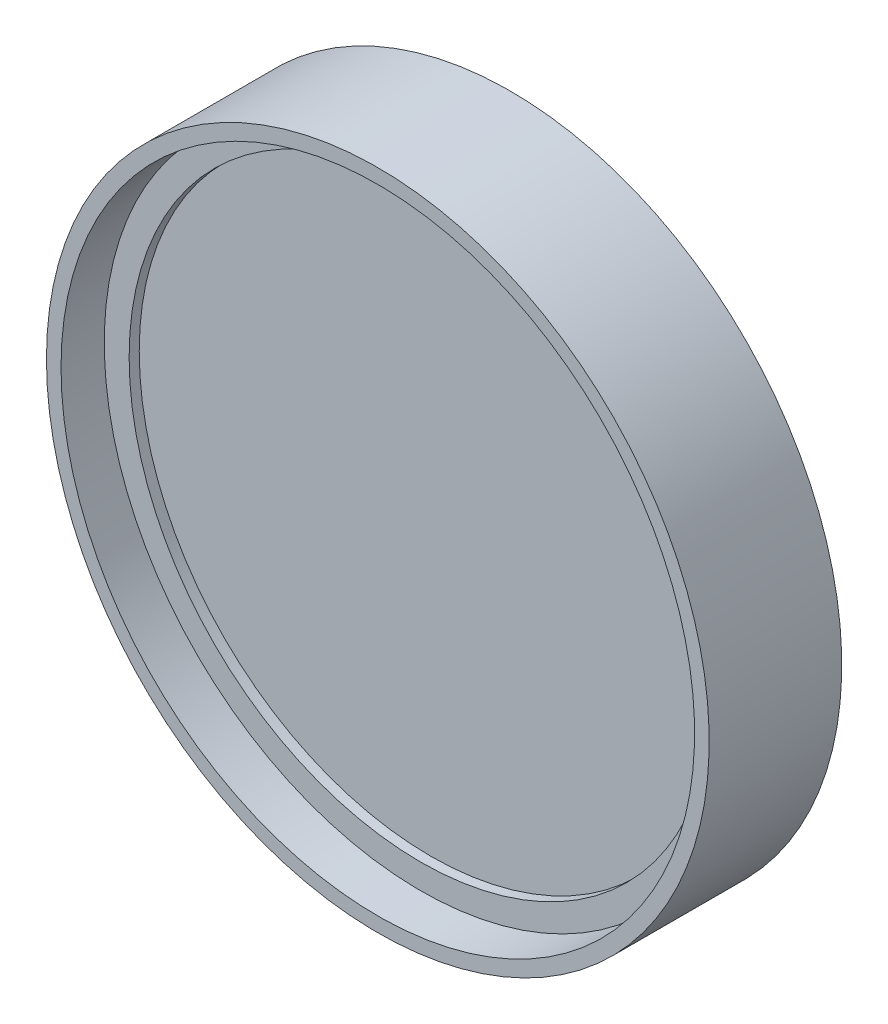
ISO-10303-21;
HEADER;
FILE_DESCRIPTION(('STEP AP214'),'2;1');
FILE_NAME('part.step','',(''),(''),'','','');
FILE_SCHEMA(('AUTOMOTIVE_DESIGN { 1 0 10303 214 1 1 1 1 }'));
ENDSEC;
DATA;
#1=APPLICATION_CONTEXT('core data for automotive mechanical design processes');
#2=APPLICATION_PROTOCOL_DEFINITION('international standard','automotive_design',2000,#1);
#3=PRODUCT_CONTEXT('',#1,'mechanical');
#4=PRODUCT('Part','Part','',(#3));
#5=PRODUCT_RELATED_PRODUCT_CATEGORY('part','',(#4));
#6=PRODUCT_DEFINITION_FORMATION('','',#4);
#7=PRODUCT_DEFINITION_CONTEXT('part definition',#1,'design');
#8=PRODUCT_DEFINITION('design','',#6,#7);
#9=PRODUCT_DEFINITION_SHAPE('','',#8);
#10=(LENGTH_UNIT() NAMED_UNIT(*) SI_UNIT(.MILLI.,.METRE.));
#11=(NAMED_UNIT(*) PLANE_ANGLE_UNIT() SI_UNIT($,.RADIAN.));
#12=(NAMED_UNIT(*) SI_UNIT($,.STERADIAN.) SOLID_ANGLE_UNIT());
#13=UNCERTAINTY_MEASURE_WITH_UNIT(LENGTH_MEASURE(1.E-05),#10,'distance_accuracy_value','');
#14=(GEOMETRIC_REPRESENTATION_CONTEXT(3) GLOBAL_UNCERTAINTY_ASSIGNED_CONTEXT((#13)) GLOBAL_UNIT_ASSIGNED_CONTEXT((#10,
#11,#12)) REPRESENTATION_CONTEXT('',''));
#15=CARTESIAN_POINT('',(0.,0.,0.));
#16=DIRECTION('',(0.,0.,1.));
#17=DIRECTION('',(1.,0.,0.));
#18=AXIS2_PLACEMENT_3D('',#15,#16,#17);
#19=CARTESIAN_POINT('',(0.,0.,2.381));
#20=DIRECTION('',(0.,0.,1.));
#21=DIRECTION('',(1.,0.,0.));
#22=AXIS2_PLACEMENT_3D('',#19,#20,#21);
#23=PLANE('',#22);
#24=CARTESIAN_POINT('',(0.,0.,2.381));
#25=DIRECTION('',(0.,0.,1.));
#26=DIRECTION('',(1.,0.,0.));
#27=AXIS2_PLACEMENT_3D('',#24,#25,#26);
#28=CIRCLE('',#27,11.938);
#29=CARTESIAN_POINT('',(11.938,0.,2.381));
#30=VERTEX_POINT('',#29);
#31=EDGE_CURVE('E10',#30,#30,#28,.T.);
#32=ORIENTED_EDGE('',*,*,#31,.F.);
#33=EDGE_LOOP('',(#32));
#34=FACE_BOUND('',#33,.T.);
#35=CARTESIAN_POINT('',(0.,0.,2.381));
#36=DIRECTION('',(0.,0.,1.));
#37=DIRECTION('',(1.,0.,0.));
#38=AXIS2_PLACEMENT_3D('',#35,#36,#37);
#39=CIRCLE('',#38,11.95);
#40=CARTESIAN_POINT('',(11.95,0.,2.381));
#41=VERTEX_POINT('',#40);
#42=EDGE_CURVE('E47',#41,#41,#39,.F.);
#43=ORIENTED_EDGE('',*,*,#42,.F.);
#44=EDGE_LOOP('',(#43));
#45=FACE_BOUND('',#44,.T.);
#46=ADVANCED_FACE('F36',(#34,#45),#23,.T.);
#47=CARTESIAN_POINT('',(0.,0.,-0.619));
#48=DIRECTION('',(0.,0.,-1.));
#49=DIRECTION('',(-1.,0.,0.));
#50=AXIS2_PLACEMENT_3D('',#47,#48,#49);
#51=PLANE('',#50);
#52=CARTESIAN_POINT('',(0.,0.,-0.619));
#53=DIRECTION('',(0.,0.,-1.));
#54=DIRECTION('',(-1.,0.,0.));
#55=AXIS2_PLACEMENT_3D('',#52,#53,#54);
#56=CIRCLE('',#55,11.);
#57=CARTESIAN_POINT('',(-11.,0.,-0.619));
#58=VERTEX_POINT('',#57);
#59=EDGE_CURVE('E81',#58,#58,#56,.T.);
#60=ORIENTED_EDGE('',*,*,#59,.F.);
#61=EDGE_LOOP('',(#60));
#62=FACE_BOUND('',#61,.T.);
#63=CARTESIAN_POINT('',(0.,0.,-0.619));
#64=DIRECTION('',(0.,0.,-1.));
#65=DIRECTION('',(-1.,0.,0.));
#66=AXIS2_PLACEMENT_3D('',#63,#64,#65);
#67=CIRCLE('',#66,12.5);
#68=CARTESIAN_POINT('',(-12.5,0.,-0.619));
#69=VERTEX_POINT('',#68);
#70=EDGE_CURVE('E56',#69,#69,#67,.T.);
#71=ORIENTED_EDGE('',*,*,#70,.T.);
#72=EDGE_LOOP('',(#71));
#73=FACE_BOUND('',#72,.T.);
#74=ADVANCED_FACE('F96',(#62,#73),#51,.T.);
#75=CARTESIAN_POINT('',(0.,0.,-3.68547493251293));
#76=DIRECTION('',(0.,0.,-1.));
#77=DIRECTION('',(-1.,0.,0.));
#78=AXIS2_PLACEMENT_3D('',#75,#76,#77);
#79=CYLINDRICAL_SURFACE('',#78,12.5);
#80=CARTESIAN_POINT('',(0.,0.,4.381));
#81=DIRECTION('',(0.,0.,-1.));
#82=DIRECTION('',(-1.,0.,0.));
#83=AXIS2_PLACEMENT_3D('',#80,#81,#82);
#84=CIRCLE('',#83,12.5);
#85=CARTESIAN_POINT('',(-12.5,0.,4.381));
#86=VERTEX_POINT('',#85);
#87=EDGE_CURVE('E59',#86,#86,#84,.T.);
#88=ORIENTED_EDGE('',*,*,#87,.T.);
#89=EDGE_LOOP('',(#88));
#90=FACE_BOUND('',#89,.T.);
#91=ORIENTED_EDGE('',*,*,#70,.F.);
#92=EDGE_LOOP('',(#91));
#93=FACE_BOUND('',#92,.T.);
#94=ADVANCED_FACE('F99',(#90,#93),#79,.T.);
#95=CARTESIAN_POINT('',(-11.95,0.,4.381));
#96=DIRECTION('',(0.,0.,1.));
#97=DIRECTION('',(1.,0.,0.));
#98=AXIS2_PLACEMENT_3D('',#95,#96,#97);
#99=PLANE('',#98);
#100=CARTESIAN_POINT('',(0.,0.,4.381));
#101=DIRECTION('',(0.,0.,-1.));
#102=DIRECTION('',(-1.,0.,0.));
#103=AXIS2_PLACEMENT_3D('',#100,#101,#102);
#104=CIRCLE('',#103,11.95);
#105=CARTESIAN_POINT('',(-11.95,0.,4.381));
#106=VERTEX_POINT('',#105);
#107=EDGE_CURVE('E62',#106,#106,#104,.T.);
#108=ORIENTED_EDGE('',*,*,#107,.T.);
#109=EDGE_LOOP('',(#108));
#110=FACE_BOUND('',#109,.T.);
#111=ORIENTED_EDGE('',*,*,#87,.F.);
#112=EDGE_LOOP('',(#111));
#113=FACE_BOUND('',#112,.T.);
#114=ADVANCED_FACE('F104',(#110,#113),#99,.T.);
#115=CARTESIAN_POINT('',(0.,0.,-3.68547493251293));
#116=DIRECTION('',(0.,0.,-1.));
#117=DIRECTION('',(-1.,0.,0.));
#118=AXIS2_PLACEMENT_3D('',#115,#116,#117);
#119=CYLINDRICAL_SURFACE('',#118,11.95);
#120=ORIENTED_EDGE('',*,*,#42,.T.);
#121=EDGE_LOOP('',(#120));
#122=FACE_BOUND('',#121,.T.);
#123=ORIENTED_EDGE('',*,*,#107,.F.);
#124=EDGE_LOOP('',(#123));
#125=FACE_BOUND('',#124,.T.);
#126=ADVANCED_FACE('F110',(#122,#125),#119,.F.);
#127=CARTESIAN_POINT('',(0.,0.,2.762));
#128=DIRECTION('',(0.,0.,1.));
#129=DIRECTION('',(1.,0.,0.));
#130=AXIS2_PLACEMENT_3D('',#127,#128,#129);
#131=PLANE('',#130);
#132=CARTESIAN_POINT('',(0.,0.,2.762));
#133=DIRECTION('',(0.,0.,1.));
#134=DIRECTION('',(1.,0.,0.));
#135=AXIS2_PLACEMENT_3D('',#132,#133,#134);
#136=CIRCLE('',#135,11.);
#137=CARTESIAN_POINT('',(11.,0.,2.762));
#138=VERTEX_POINT('',#137);
#139=EDGE_CURVE('E77',#138,#138,#136,.T.);
#140=ORIENTED_EDGE('',*,*,#139,.F.);
#141=EDGE_LOOP('',(#140));
#142=FACE_BOUND('',#141,.T.);
#143=CARTESIAN_POINT('',(0.,0.,2.762));
#144=DIRECTION('',(0.,0.,1.));
#145=DIRECTION('',(1.,0.,0.));
#146=AXIS2_PLACEMENT_3D('',#143,#144,#145);
#147=CIRCLE('',#146,11.938);
#148=CARTESIAN_POINT('',(11.938,0.,2.762));
#149=VERTEX_POINT('',#148);
#150=EDGE_CURVE('E71',#149,#149,#147,.F.);
#151=ORIENTED_EDGE('',*,*,#150,.F.);
#152=EDGE_LOOP('',(#151));
#153=FACE_BOUND('',#152,.T.);
#154=ADVANCED_FACE('F129',(#142,#153),#131,.T.);
#155=CARTESIAN_POINT('',(0.,0.,2.381));
#156=DIRECTION('',(0.,0.,1.));
#157=DIRECTION('',(1.,0.,0.));
#158=AXIS2_PLACEMENT_3D('',#155,#156,#157);
#159=CYLINDRICAL_SURFACE('',#158,11.938);
#160=ORIENTED_EDGE('',*,*,#150,.T.);
#161=EDGE_LOOP('',(#160));
#162=FACE_BOUND('',#161,.T.);
#163=ORIENTED_EDGE('',*,*,#31,.T.);
#164=EDGE_LOOP('',(#163));
#165=FACE_BOUND('',#164,.T.);
#166=ADVANCED_FACE('F126',(#162,#165),#159,.T.);
#167=CARTESIAN_POINT('',(0.,0.,-28.7316983722081));
#168=DIRECTION('',(0.,0.,1.));
#169=DIRECTION('',(1.,0.,0.));
#170=AXIS2_PLACEMENT_3D('',#167,#168,#169);
#171=CYLINDRICAL_SURFACE('',#170,11.);
#172=CARTESIAN_POINT('',(0.,0.,2.381));
#173=DIRECTION('',(0.,0.,1.));
#174=DIRECTION('',(1.,0.,0.));
#175=AXIS2_PLACEMENT_3D('',#172,#173,#174);
#176=CIRCLE('',#175,11.);
#177=CARTESIAN_POINT('',(11.,0.,2.381));
#178=VERTEX_POINT('',#177);
#179=EDGE_CURVE('E74',#178,#178,#176,.F.);
#180=ORIENTED_EDGE('',*,*,#179,.T.);
#181=EDGE_LOOP('',(#180));
#182=FACE_BOUND('',#181,.T.);
#183=ORIENTED_EDGE('',*,*,#139,.T.);
#184=EDGE_LOOP('',(#183));
#185=FACE_BOUND('',#184,.T.);
#186=ADVANCED_FACE('F119',(#182,#185),#171,.F.);
#187=ORIENTED_EDGE('',*,*,#179,.F.);
#188=EDGE_LOOP('',(#187));
#189=FACE_BOUND('',#188,.T.);
#190=ADVANCED_FACE('F92',(#189),#23,.T.);
#191=CARTESIAN_POINT('',(0.,0.,0.381));
#192=DIRECTION('',(0.,0.,-1.));
#193=DIRECTION('',(-1.,0.,0.));
#194=AXIS2_PLACEMENT_3D('',#191,#192,#193);
#195=CYLINDRICAL_SURFACE('',#194,11.);
#196=CARTESIAN_POINT('',(0.,0.,0.381));
#197=DIRECTION('',(0.,0.,-1.));
#198=DIRECTION('',(-1.,0.,0.));
#199=AXIS2_PLACEMENT_3D('',#196,#197,#198);
#200=CIRCLE('',#199,11.);
#201=CARTESIAN_POINT('',(-11.,0.,0.381));
#202=VERTEX_POINT('',#201);
#203=EDGE_CURVE('E80',#202,#202,#200,.T.);
#204=ORIENTED_EDGE('',*,*,#203,.F.);
#205=EDGE_LOOP('',(#204));
#206=FACE_BOUND('',#205,.T.);
#207=ORIENTED_EDGE('',*,*,#59,.T.);
#208=EDGE_LOOP('',(#207));
#209=FACE_BOUND('',#208,.T.);
#210=ADVANCED_FACE('F89',(#206,#209),#195,.F.);
#211=CARTESIAN_POINT('',(0.,0.,0.381));
#212=DIRECTION('',(0.,0.,-1.));
#213=DIRECTION('',(-1.,0.,0.));
#214=AXIS2_PLACEMENT_3D('',#211,#212,#213);
#215=PLANE('',#214);
#216=ORIENTED_EDGE('',*,*,#203,.T.);
#217=EDGE_LOOP('',(#216));
#218=FACE_BOUND('',#217,.T.);
#219=ADVANCED_FACE('F87',(#218),#215,.T.);
#220=CLOSED_SHELL('',(#46,#74,#94,#114,#126,#154,#166,#186,#190,#210,#219));
#221=CARTESIAN_POINT('',(0.,0.,0.381000000000001));
#222=DIRECTION('',(0.,0.,1.));
#223=DIRECTION('',(1.,0.,0.));
#224=AXIS2_PLACEMENT_3D('',#221,#222,#223);
#225=CYLINDRICAL_SURFACE('',#224,11.95);
#226=CARTESIAN_POINT('',(0.,0.,0.581000000000001));
#227=DIRECTION('',(0.,0.,-1.));
#228=DIRECTION('',(-1.,0.,0.));
#229=AXIS2_PLACEMENT_3D('',#226,#227,#228);
#230=CIRCLE('',#229,11.95);
#231=CARTESIAN_POINT('',(-11.95,0.,0.581000000000001));
#232=VERTEX_POINT('',#231);
#233=EDGE_CURVE('E43',#232,#232,#230,.F.);
#234=ORIENTED_EDGE('',*,*,#233,.F.);
#235=EDGE_LOOP('',(#234));
#236=FACE_BOUND('',#235,.T.);
#237=CARTESIAN_POINT('',(0.,0.,0.381000000000001));
#238=DIRECTION('',(0.,0.,1.));
#239=DIRECTION('',(1.,0.,0.));
#240=AXIS2_PLACEMENT_3D('',#237,#238,#239);
#241=CIRCLE('',#240,11.95);
#242=CARTESIAN_POINT('',(11.95,0.,0.381000000000001));
#243=VERTEX_POINT('',#242);
#244=EDGE_CURVE('E51',#243,#243,#241,.F.);
#245=ORIENTED_EDGE('',*,*,#244,.F.);
#246=EDGE_LOOP('',(#245));
#247=FACE_BOUND('',#246,.T.);
#248=ADVANCED_FACE('F154',(#236,#247),#225,.T.);
#249=CARTESIAN_POINT('',(-12.15,0.,0.581000000000001));
#250=DIRECTION('',(0.,0.,-1.));
#251=DIRECTION('',(-1.,0.,0.));
#252=AXIS2_PLACEMENT_3D('',#249,#250,#251);
#253=PLANE('',#252);
#254=CARTESIAN_POINT('',(0.,0.,0.581000000000002));
#255=DIRECTION('',(0.,0.,-1.));
#256=DIRECTION('',(-1.,0.,0.));
#257=AXIS2_PLACEMENT_3D('',#254,#255,#256);
#258=CIRCLE('',#257,12.15);
#259=CARTESIAN_POINT('',(-12.15,0.,0.581000000000002));
#260=VERTEX_POINT('',#259);
#261=EDGE_CURVE('E65',#260,#260,#258,.T.);
#262=ORIENTED_EDGE('',*,*,#261,.T.);
#263=EDGE_LOOP('',(#262));
#264=FACE_BOUND('',#263,.T.);
#265=ORIENTED_EDGE('',*,*,#233,.T.);
#266=EDGE_LOOP('',(#265));
#267=FACE_BOUND('',#266,.T.);
#268=ADVANCED_FACE('F150',(#264,#267),#253,.T.);
#269=CARTESIAN_POINT('',(0.,0.,-3.68547493251293));
#270=DIRECTION('',(0.,0.,-1.));
#271=DIRECTION('',(-1.,0.,0.));
#272=AXIS2_PLACEMENT_3D('',#269,#270,#271);
#273=CYLINDRICAL_SURFACE('',#272,12.15);
#274=CARTESIAN_POINT('',(0.,0.,0.381000000000001));
#275=DIRECTION('',(0.,0.,-1.));
#276=DIRECTION('',(-1.,0.,0.));
#277=AXIS2_PLACEMENT_3D('',#274,#275,#276);
#278=CIRCLE('',#277,12.15);
#279=CARTESIAN_POINT('',(-12.15,0.,0.381000000000001));
#280=VERTEX_POINT('',#279);
#281=EDGE_CURVE('E68',#280,#280,#278,.T.);
#282=ORIENTED_EDGE('',*,*,#281,.T.);
#283=EDGE_LOOP('',(#282));
#284=FACE_BOUND('',#283,.T.);
#285=ORIENTED_EDGE('',*,*,#261,.F.);
#286=EDGE_LOOP('',(#285));
#287=FACE_BOUND('',#286,.T.);
#288=ADVANCED_FACE('F153',(#284,#287),#273,.F.);
#289=CARTESIAN_POINT('',(0.,0.,0.381000000000001));
#290=DIRECTION('',(0.,0.,1.));
#291=DIRECTION('',(1.,0.,0.));
#292=AXIS2_PLACEMENT_3D('',#289,#290,#291);
#293=PLANE('',#292);
#294=ORIENTED_EDGE('',*,*,#244,.T.);
#295=EDGE_LOOP('',(#294));
#296=FACE_BOUND('',#295,.T.);
#297=ORIENTED_EDGE('',*,*,#281,.F.);
#298=EDGE_LOOP('',(#297));
#299=FACE_BOUND('',#298,.T.);
#300=ADVANCED_FACE('F159',(#296,#299),#293,.T.);
#301=CLOSED_SHELL('',(#248,#268,#288,#300));
#302=ORIENTED_CLOSED_SHELL('',*,#301,.T.);
#303=BREP_WITH_VOIDS('B2',#220,(#302));
#304=ADVANCED_BREP_SHAPE_REPRESENTATION('',(#18,#303),#14);
#305=SHAPE_DEFINITION_REPRESENTATION(#9,#304);
ENDSEC;
END-ISO-10303-21;
